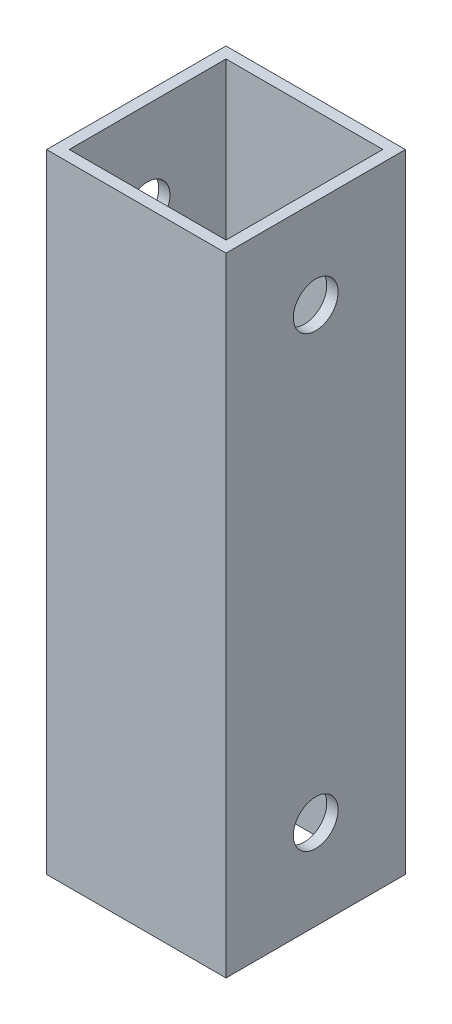
ISO-10303-21;
HEADER;
FILE_DESCRIPTION(('STEP AP214'),'2;1');
FILE_NAME('part.step','',(''),(''),'','','');
FILE_SCHEMA(('AUTOMOTIVE_DESIGN { 1 0 10303 214 1 1 1 1 }'));
ENDSEC;
DATA;
#1=APPLICATION_CONTEXT('core data for automotive mechanical design processes');
#2=APPLICATION_PROTOCOL_DEFINITION('international standard','automotive_design',2000,#1);
#3=PRODUCT_CONTEXT('',#1,'mechanical');
#4=PRODUCT('Part','Part','',(#3));
#5=PRODUCT_RELATED_PRODUCT_CATEGORY('part','',(#4));
#6=PRODUCT_DEFINITION_FORMATION('','',#4);
#7=PRODUCT_DEFINITION_CONTEXT('part definition',#1,'design');
#8=PRODUCT_DEFINITION('design','',#6,#7);
#9=PRODUCT_DEFINITION_SHAPE('','',#8);
#10=(LENGTH_UNIT() NAMED_UNIT(*) SI_UNIT(.MILLI.,.METRE.));
#11=(NAMED_UNIT(*) PLANE_ANGLE_UNIT() SI_UNIT($,.RADIAN.));
#12=(NAMED_UNIT(*) SI_UNIT($,.STERADIAN.) SOLID_ANGLE_UNIT());
#13=UNCERTAINTY_MEASURE_WITH_UNIT(LENGTH_MEASURE(1.E-05),#10,'distance_accuracy_value','');
#14=(GEOMETRIC_REPRESENTATION_CONTEXT(3) GLOBAL_UNCERTAINTY_ASSIGNED_CONTEXT((#13)) GLOBAL_UNIT_ASSIGNED_CONTEXT((#10,
#11,#12)) REPRESENTATION_CONTEXT('',''));
#15=CARTESIAN_POINT('',(0.,0.,0.));
#16=DIRECTION('',(0.,0.,1.));
#17=DIRECTION('',(1.,0.,0.));
#18=AXIS2_PLACEMENT_3D('',#15,#16,#17);
#19=CARTESIAN_POINT('',(0.,177.8,0.));
#20=DIRECTION('',(0.,1.,0.));
#21=DIRECTION('',(0.,0.,1.));
#22=AXIS2_PLACEMENT_3D('',#19,#20,#21);
#23=PLANE('',#22);
#24=DIRECTION('',(0.,0.,1.));
#25=VECTOR('',#24,1.);
#26=CARTESIAN_POINT('',(-25.4,177.8,-25.4));
#27=LINE('',#26,#25);
#28=CARTESIAN_POINT('',(-25.4,177.8,-25.4));
#29=VERTEX_POINT('',#28);
#30=CARTESIAN_POINT('',(-25.4,177.8,25.4));
#31=VERTEX_POINT('',#30);
#32=EDGE_CURVE('E137',#29,#31,#27,.T.);
#33=ORIENTED_EDGE('',*,*,#32,.T.);
#34=DIRECTION('',(1.,0.,0.));
#35=VECTOR('',#34,1.);
#36=CARTESIAN_POINT('',(-25.4,177.8,25.4));
#37=LINE('',#36,#35);
#38=CARTESIAN_POINT('',(25.4,177.8,25.4));
#39=VERTEX_POINT('',#38);
#40=EDGE_CURVE('E140',#31,#39,#37,.T.);
#41=ORIENTED_EDGE('',*,*,#40,.T.);
#42=DIRECTION('',(0.,0.,-1.));
#43=VECTOR('',#42,1.);
#44=CARTESIAN_POINT('',(25.4,177.8,-25.4));
#45=LINE('',#44,#43);
#46=CARTESIAN_POINT('',(25.4,177.8,-25.4));
#47=VERTEX_POINT('',#46);
#48=EDGE_CURVE('E143',#39,#47,#45,.T.);
#49=ORIENTED_EDGE('',*,*,#48,.T.);
#50=DIRECTION('',(-1.,0.,0.));
#51=VECTOR('',#50,1.);
#52=CARTESIAN_POINT('',(-25.4,177.8,-25.4));
#53=LINE('',#52,#51);
#54=EDGE_CURVE('E145',#47,#29,#53,.T.);
#55=ORIENTED_EDGE('',*,*,#54,.T.);
#56=EDGE_LOOP('',(#33,#41,#49,#55));
#57=FACE_BOUND('',#56,.T.);
#58=DIRECTION('',(1.,0.,0.));
#59=VECTOR('',#58,1.);
#60=CARTESIAN_POINT('',(-22.225,177.8,22.1917539267016));
#61=LINE('',#60,#59);
#62=CARTESIAN_POINT('',(-22.225,177.8,22.1917539267016));
#63=VERTEX_POINT('',#62);
#64=CARTESIAN_POINT('',(22.1917539267016,177.8,22.1917539267016));
#65=VERTEX_POINT('',#64);
#66=EDGE_CURVE('E107',#63,#65,#61,.T.);
#67=ORIENTED_EDGE('',*,*,#66,.F.);
#68=DIRECTION('',(0.,0.,1.));
#69=VECTOR('',#68,1.);
#70=CARTESIAN_POINT('',(-22.225,177.8,-22.225));
#71=LINE('',#70,#69);
#72=CARTESIAN_POINT('',(-22.225,177.8,-22.225));
#73=VERTEX_POINT('',#72);
#74=EDGE_CURVE('E99',#73,#63,#71,.T.);
#75=ORIENTED_EDGE('',*,*,#74,.F.);
#76=DIRECTION('',(-1.,0.,0.));
#77=VECTOR('',#76,1.);
#78=CARTESIAN_POINT('',(-22.225,177.8,-22.225));
#79=LINE('',#78,#77);
#80=CARTESIAN_POINT('',(22.1917539267016,177.8,-22.225));
#81=VERTEX_POINT('',#80);
#82=EDGE_CURVE('E121',#81,#73,#79,.T.);
#83=ORIENTED_EDGE('',*,*,#82,.F.);
#84=DIRECTION('',(0.,0.,-1.));
#85=VECTOR('',#84,1.);
#86=CARTESIAN_POINT('',(22.1917539267016,177.8,-22.225));
#87=LINE('',#86,#85);
#88=EDGE_CURVE('E119',#65,#81,#87,.T.);
#89=ORIENTED_EDGE('',*,*,#88,.F.);
#90=EDGE_LOOP('',(#67,#75,#83,#89));
#91=FACE_BOUND('',#90,.T.);
#92=ADVANCED_FACE('F32',(#57,#91),#23,.T.);
#93=CARTESIAN_POINT('',(0.,0.,0.));
#94=DIRECTION('',(0.,1.,0.));
#95=DIRECTION('',(0.,0.,1.));
#96=AXIS2_PLACEMENT_3D('',#93,#94,#95);
#97=PLANE('',#96);
#98=DIRECTION('',(0.,0.,1.));
#99=VECTOR('',#98,1.);
#100=CARTESIAN_POINT('',(-25.4,0.,-25.4));
#101=LINE('',#100,#99);
#102=CARTESIAN_POINT('',(-25.4,0.,-25.4));
#103=VERTEX_POINT('',#102);
#104=CARTESIAN_POINT('',(-25.4,0.,25.4));
#105=VERTEX_POINT('',#104);
#106=EDGE_CURVE('E115',#103,#105,#101,.T.);
#107=ORIENTED_EDGE('',*,*,#106,.F.);
#108=DIRECTION('',(-1.,0.,0.));
#109=VECTOR('',#108,1.);
#110=CARTESIAN_POINT('',(-25.4,0.,-25.4));
#111=LINE('',#110,#109);
#112=CARTESIAN_POINT('',(25.4,0.,-25.4));
#113=VERTEX_POINT('',#112);
#114=EDGE_CURVE('E141',#113,#103,#111,.T.);
#115=ORIENTED_EDGE('',*,*,#114,.F.);
#116=DIRECTION('',(0.,0.,-1.));
#117=VECTOR('',#116,1.);
#118=CARTESIAN_POINT('',(25.4,0.,-25.4));
#119=LINE('',#118,#117);
#120=CARTESIAN_POINT('',(25.4,0.,25.4));
#121=VERTEX_POINT('',#120);
#122=EDGE_CURVE('E152',#121,#113,#119,.T.);
#123=ORIENTED_EDGE('',*,*,#122,.F.);
#124=DIRECTION('',(1.,0.,0.));
#125=VECTOR('',#124,1.);
#126=CARTESIAN_POINT('',(-25.4,0.,25.4));
#127=LINE('',#126,#125);
#128=EDGE_CURVE('E150',#105,#121,#127,.T.);
#129=ORIENTED_EDGE('',*,*,#128,.F.);
#130=EDGE_LOOP('',(#107,#115,#123,#129));
#131=FACE_BOUND('',#130,.T.);
#132=DIRECTION('',(0.,0.,1.));
#133=VECTOR('',#132,1.);
#134=CARTESIAN_POINT('',(-22.225,0.,-22.225));
#135=LINE('',#134,#133);
#136=CARTESIAN_POINT('',(-22.225,0.,-22.225));
#137=VERTEX_POINT('',#136);
#138=CARTESIAN_POINT('',(-22.225,0.,22.1917539267016));
#139=VERTEX_POINT('',#138);
#140=EDGE_CURVE('E57',#137,#139,#135,.T.);
#141=ORIENTED_EDGE('',*,*,#140,.T.);
#142=DIRECTION('',(1.,0.,0.));
#143=VECTOR('',#142,1.);
#144=CARTESIAN_POINT('',(-22.225,0.,22.1917539267016));
#145=LINE('',#144,#143);
#146=CARTESIAN_POINT('',(22.1917539267016,0.,22.1917539267016));
#147=VERTEX_POINT('',#146);
#148=EDGE_CURVE('E114',#139,#147,#145,.T.);
#149=ORIENTED_EDGE('',*,*,#148,.T.);
#150=DIRECTION('',(0.,0.,-1.));
#151=VECTOR('',#150,1.);
#152=CARTESIAN_POINT('',(22.1917539267016,0.,-22.225));
#153=LINE('',#152,#151);
#154=CARTESIAN_POINT('',(22.1917539267016,0.,-22.225));
#155=VERTEX_POINT('',#154);
#156=EDGE_CURVE('E129',#147,#155,#153,.T.);
#157=ORIENTED_EDGE('',*,*,#156,.T.);
#158=DIRECTION('',(-1.,0.,0.));
#159=VECTOR('',#158,1.);
#160=CARTESIAN_POINT('',(-22.225,0.,-22.225));
#161=LINE('',#160,#159);
#162=EDGE_CURVE('E108',#155,#137,#161,.T.);
#163=ORIENTED_EDGE('',*,*,#162,.T.);
#164=EDGE_LOOP('',(#141,#149,#157,#163));
#165=FACE_BOUND('',#164,.T.);
#166=ADVANCED_FACE('F199',(#131,#165),#97,.F.);
#167=CARTESIAN_POINT('',(-25.4,177.8,-25.4));
#168=DIRECTION('',(1.,0.,0.));
#169=DIRECTION('',(0.,0.,-1.));
#170=AXIS2_PLACEMENT_3D('',#167,#168,#169);
#171=PLANE('',#170);
#172=CARTESIAN_POINT('',(-25.4,25.4,0.));
#173=DIRECTION('',(-1.,0.,0.));
#174=DIRECTION('',(0.,0.,1.));
#175=AXIS2_PLACEMENT_3D('',#172,#173,#174);
#176=CIRCLE('',#175,6.35);
#177=CARTESIAN_POINT('',(-25.4,25.4,6.34999999999997));
#178=VERTEX_POINT('',#177);
#179=EDGE_CURVE('E170',#178,#178,#176,.T.);
#180=ORIENTED_EDGE('',*,*,#179,.F.);
#181=EDGE_LOOP('',(#180));
#182=FACE_BOUND('',#181,.T.);
#183=CARTESIAN_POINT('',(-25.4,152.4,0.));
#184=DIRECTION('',(-1.,0.,0.));
#185=DIRECTION('',(0.,0.,1.));
#186=AXIS2_PLACEMENT_3D('',#183,#184,#185);
#187=CIRCLE('',#186,6.34999999999999);
#188=CARTESIAN_POINT('',(-25.4,152.4,6.34999999999995));
#189=VERTEX_POINT('',#188);
#190=EDGE_CURVE('E180',#189,#189,#187,.T.);
#191=ORIENTED_EDGE('',*,*,#190,.F.);
#192=EDGE_LOOP('',(#191));
#193=FACE_BOUND('',#192,.T.);
#194=ORIENTED_EDGE('',*,*,#106,.T.);
#195=DIRECTION('',(0.,-1.,0.));
#196=VECTOR('',#195,1.);
#197=CARTESIAN_POINT('',(-25.4,177.8,25.4));
#198=LINE('',#197,#196);
#199=EDGE_CURVE('E11',#31,#105,#198,.T.);
#200=ORIENTED_EDGE('',*,*,#199,.F.);
#201=ORIENTED_EDGE('',*,*,#32,.F.);
#202=DIRECTION('',(0.,-1.,0.));
#203=VECTOR('',#202,1.);
#204=CARTESIAN_POINT('',(-25.4,177.8,-25.4));
#205=LINE('',#204,#203);
#206=EDGE_CURVE('E147',#29,#103,#205,.T.);
#207=ORIENTED_EDGE('',*,*,#206,.T.);
#208=EDGE_LOOP('',(#194,#200,#201,#207));
#209=FACE_BOUND('',#208,.T.);
#210=ADVANCED_FACE('F34',(#182,#193,#209),#171,.F.);
#211=CARTESIAN_POINT('',(-25.4,177.8,25.4));
#212=DIRECTION('',(0.,0.,-1.));
#213=DIRECTION('',(-1.,0.,0.));
#214=AXIS2_PLACEMENT_3D('',#211,#212,#213);
#215=PLANE('',#214);
#216=ORIENTED_EDGE('',*,*,#128,.T.);
#217=DIRECTION('',(0.,-1.,0.));
#218=VECTOR('',#217,1.);
#219=CARTESIAN_POINT('',(25.4,177.8,25.4));
#220=LINE('',#219,#218);
#221=EDGE_CURVE('E41',#39,#121,#220,.T.);
#222=ORIENTED_EDGE('',*,*,#221,.F.);
#223=ORIENTED_EDGE('',*,*,#40,.F.);
#224=ORIENTED_EDGE('',*,*,#199,.T.);
#225=EDGE_LOOP('',(#216,#222,#223,#224));
#226=FACE_BOUND('',#225,.T.);
#227=ADVANCED_FACE('F225',(#226),#215,.F.);
#228=CARTESIAN_POINT('',(25.4,177.8,-25.4));
#229=DIRECTION('',(-1.,0.,0.));
#230=DIRECTION('',(0.,0.,1.));
#231=AXIS2_PLACEMENT_3D('',#228,#229,#230);
#232=PLANE('',#231);
#233=CARTESIAN_POINT('',(25.4,25.4,0.));
#234=DIRECTION('',(-1.,0.,0.));
#235=DIRECTION('',(0.,0.,1.));
#236=AXIS2_PLACEMENT_3D('',#233,#234,#235);
#237=CIRCLE('',#236,6.35);
#238=CARTESIAN_POINT('',(25.4,25.4,6.34999999999996));
#239=VERTEX_POINT('',#238);
#240=EDGE_CURVE('E164',#239,#239,#237,.T.);
#241=ORIENTED_EDGE('',*,*,#240,.T.);
#242=EDGE_LOOP('',(#241));
#243=FACE_BOUND('',#242,.T.);
#244=CARTESIAN_POINT('',(25.4,152.4,0.));
#245=DIRECTION('',(-1.,0.,0.));
#246=DIRECTION('',(0.,0.,1.));
#247=AXIS2_PLACEMENT_3D('',#244,#245,#246);
#248=CIRCLE('',#247,6.34999999999999);
#249=CARTESIAN_POINT('',(25.4,152.4,6.34999999999993));
#250=VERTEX_POINT('',#249);
#251=EDGE_CURVE('E175',#250,#250,#248,.T.);
#252=ORIENTED_EDGE('',*,*,#251,.T.);
#253=EDGE_LOOP('',(#252));
#254=FACE_BOUND('',#253,.T.);
#255=ORIENTED_EDGE('',*,*,#122,.T.);
#256=DIRECTION('',(0.,-1.,0.));
#257=VECTOR('',#256,1.);
#258=CARTESIAN_POINT('',(25.4,177.8,-25.4));
#259=LINE('',#258,#257);
#260=EDGE_CURVE('E157',#47,#113,#259,.T.);
#261=ORIENTED_EDGE('',*,*,#260,.F.);
#262=ORIENTED_EDGE('',*,*,#48,.F.);
#263=ORIENTED_EDGE('',*,*,#221,.T.);
#264=EDGE_LOOP('',(#255,#261,#262,#263));
#265=FACE_BOUND('',#264,.T.);
#266=ADVANCED_FACE('F222',(#243,#254,#265),#232,.F.);
#267=CARTESIAN_POINT('',(-25.4,177.8,-25.4));
#268=DIRECTION('',(0.,0.,1.));
#269=DIRECTION('',(1.,0.,0.));
#270=AXIS2_PLACEMENT_3D('',#267,#268,#269);
#271=PLANE('',#270);
#272=ORIENTED_EDGE('',*,*,#114,.T.);
#273=ORIENTED_EDGE('',*,*,#206,.F.);
#274=ORIENTED_EDGE('',*,*,#54,.F.);
#275=ORIENTED_EDGE('',*,*,#260,.T.);
#276=EDGE_LOOP('',(#272,#273,#274,#275));
#277=FACE_BOUND('',#276,.T.);
#278=ADVANCED_FACE('F219',(#277),#271,.F.);
#279=CARTESIAN_POINT('',(-22.225,177.8,-22.225));
#280=DIRECTION('',(1.,0.,0.));
#281=DIRECTION('',(0.,0.,-1.));
#282=AXIS2_PLACEMENT_3D('',#279,#280,#281);
#283=PLANE('',#282);
#284=CARTESIAN_POINT('',(-22.225,25.4,0.));
#285=DIRECTION('',(1.,0.,0.));
#286=DIRECTION('',(0.,0.,-1.));
#287=AXIS2_PLACEMENT_3D('',#284,#285,#286);
#288=CIRCLE('',#287,6.35);
#289=CARTESIAN_POINT('',(-22.225,25.4,-6.35000000000002));
#290=VERTEX_POINT('',#289);
#291=EDGE_CURVE('E127',#290,#290,#288,.T.);
#292=ORIENTED_EDGE('',*,*,#291,.F.);
#293=EDGE_LOOP('',(#292));
#294=FACE_BOUND('',#293,.T.);
#295=CARTESIAN_POINT('',(-22.225,152.4,0.));
#296=DIRECTION('',(1.,0.,0.));
#297=DIRECTION('',(0.,0.,-1.));
#298=AXIS2_PLACEMENT_3D('',#295,#296,#297);
#299=CIRCLE('',#298,6.34999999999999);
#300=CARTESIAN_POINT('',(-22.225,152.4,-6.35000000000004));
#301=VERTEX_POINT('',#300);
#302=EDGE_CURVE('E163',#301,#301,#299,.T.);
#303=ORIENTED_EDGE('',*,*,#302,.F.);
#304=EDGE_LOOP('',(#303));
#305=FACE_BOUND('',#304,.T.);
#306=ORIENTED_EDGE('',*,*,#140,.F.);
#307=DIRECTION('',(0.,-1.,0.));
#308=VECTOR('',#307,1.);
#309=CARTESIAN_POINT('',(-22.225,177.8,-22.225));
#310=LINE('',#309,#308);
#311=EDGE_CURVE('E103',#73,#137,#310,.T.);
#312=ORIENTED_EDGE('',*,*,#311,.F.);
#313=ORIENTED_EDGE('',*,*,#74,.T.);
#314=DIRECTION('',(0.,-1.,0.));
#315=VECTOR('',#314,1.);
#316=CARTESIAN_POINT('',(-22.225,177.8,22.1917539267016));
#317=LINE('',#316,#315);
#318=EDGE_CURVE('E102',#63,#139,#317,.T.);
#319=ORIENTED_EDGE('',*,*,#318,.T.);
#320=EDGE_LOOP('',(#306,#312,#313,#319));
#321=FACE_BOUND('',#320,.T.);
#322=ADVANCED_FACE('F101',(#294,#305,#321),#283,.T.);
#323=CARTESIAN_POINT('',(-22.225,177.8,22.1917539267016));
#324=DIRECTION('',(0.,0.,-1.));
#325=DIRECTION('',(-1.,0.,0.));
#326=AXIS2_PLACEMENT_3D('',#323,#324,#325);
#327=PLANE('',#326);
#328=ORIENTED_EDGE('',*,*,#148,.F.);
#329=ORIENTED_EDGE('',*,*,#318,.F.);
#330=ORIENTED_EDGE('',*,*,#66,.T.);
#331=DIRECTION('',(0.,-1.,0.));
#332=VECTOR('',#331,1.);
#333=CARTESIAN_POINT('',(22.1917539267016,177.8,22.1917539267016));
#334=LINE('',#333,#332);
#335=EDGE_CURVE('E116',#65,#147,#334,.T.);
#336=ORIENTED_EDGE('',*,*,#335,.T.);
#337=EDGE_LOOP('',(#328,#329,#330,#336));
#338=FACE_BOUND('',#337,.T.);
#339=ADVANCED_FACE('F111',(#338),#327,.T.);
#340=CARTESIAN_POINT('',(22.1917539267016,177.8,-22.225));
#341=DIRECTION('',(-1.,0.,0.));
#342=DIRECTION('',(0.,0.,1.));
#343=AXIS2_PLACEMENT_3D('',#340,#341,#342);
#344=PLANE('',#343);
#345=CARTESIAN_POINT('',(22.1917539267016,25.4,0.));
#346=DIRECTION('',(-1.,0.,0.));
#347=DIRECTION('',(0.,0.,1.));
#348=AXIS2_PLACEMENT_3D('',#345,#346,#347);
#349=CIRCLE('',#348,6.35);
#350=CARTESIAN_POINT('',(22.1917539267016,25.4,6.34999999999996));
#351=VERTEX_POINT('',#350);
#352=EDGE_CURVE('E36',#351,#351,#349,.T.);
#353=ORIENTED_EDGE('',*,*,#352,.F.);
#354=EDGE_LOOP('',(#353));
#355=FACE_BOUND('',#354,.T.);
#356=CARTESIAN_POINT('',(22.1917539267016,152.4,0.));
#357=DIRECTION('',(-1.,0.,0.));
#358=DIRECTION('',(0.,0.,1.));
#359=AXIS2_PLACEMENT_3D('',#356,#357,#358);
#360=CIRCLE('',#359,6.34999999999999);
#361=CARTESIAN_POINT('',(22.1917539267016,152.4,6.34999999999993));
#362=VERTEX_POINT('',#361);
#363=EDGE_CURVE('E161',#362,#362,#360,.T.);
#364=ORIENTED_EDGE('',*,*,#363,.F.);
#365=EDGE_LOOP('',(#364));
#366=FACE_BOUND('',#365,.T.);
#367=ORIENTED_EDGE('',*,*,#156,.F.);
#368=ORIENTED_EDGE('',*,*,#335,.F.);
#369=ORIENTED_EDGE('',*,*,#88,.T.);
#370=DIRECTION('',(0.,-1.,0.));
#371=VECTOR('',#370,1.);
#372=CARTESIAN_POINT('',(22.1917539267016,177.8,-22.225));
#373=LINE('',#372,#371);
#374=EDGE_CURVE('E49',#81,#155,#373,.T.);
#375=ORIENTED_EDGE('',*,*,#374,.T.);
#376=EDGE_LOOP('',(#367,#368,#369,#375));
#377=FACE_BOUND('',#376,.T.);
#378=ADVANCED_FACE('F191',(#355,#366,#377),#344,.T.);
#379=CARTESIAN_POINT('',(-22.225,177.8,-22.225));
#380=DIRECTION('',(0.,0.,1.));
#381=DIRECTION('',(1.,0.,0.));
#382=AXIS2_PLACEMENT_3D('',#379,#380,#381);
#383=PLANE('',#382);
#384=ORIENTED_EDGE('',*,*,#162,.F.);
#385=ORIENTED_EDGE('',*,*,#374,.F.);
#386=ORIENTED_EDGE('',*,*,#82,.T.);
#387=ORIENTED_EDGE('',*,*,#311,.T.);
#388=EDGE_LOOP('',(#384,#385,#386,#387));
#389=FACE_BOUND('',#388,.T.);
#390=ADVANCED_FACE('F194',(#389),#383,.T.);
#391=CARTESIAN_POINT('',(25.4,152.4,0.));
#392=DIRECTION('',(-1.,0.,0.));
#393=DIRECTION('',(0.,0.,1.));
#394=AXIS2_PLACEMENT_3D('',#391,#392,#393);
#395=CYLINDRICAL_SURFACE('',#394,6.34999999999999);
#396=ORIENTED_EDGE('',*,*,#363,.T.);
#397=EDGE_LOOP('',(#396));
#398=FACE_BOUND('',#397,.T.);
#399=ORIENTED_EDGE('',*,*,#251,.F.);
#400=EDGE_LOOP('',(#399));
#401=FACE_BOUND('',#400,.T.);
#402=ADVANCED_FACE('F201',(#398,#401),#395,.F.);
#403=CARTESIAN_POINT('',(25.4,25.4,0.));
#404=DIRECTION('',(-1.,0.,0.));
#405=DIRECTION('',(0.,0.,1.));
#406=AXIS2_PLACEMENT_3D('',#403,#404,#405);
#407=CYLINDRICAL_SURFACE('',#406,6.35);
#408=ORIENTED_EDGE('',*,*,#352,.T.);
#409=EDGE_LOOP('',(#408));
#410=FACE_BOUND('',#409,.T.);
#411=ORIENTED_EDGE('',*,*,#240,.F.);
#412=EDGE_LOOP('',(#411));
#413=FACE_BOUND('',#412,.T.);
#414=ADVANCED_FACE('F188',(#410,#413),#407,.F.);
#415=ORIENTED_EDGE('',*,*,#302,.T.);
#416=EDGE_LOOP('',(#415));
#417=FACE_BOUND('',#416,.T.);
#418=ORIENTED_EDGE('',*,*,#190,.T.);
#419=EDGE_LOOP('',(#418));
#420=FACE_BOUND('',#419,.T.);
#421=ADVANCED_FACE('F207',(#417,#420),#395,.F.);
#422=ORIENTED_EDGE('',*,*,#291,.T.);
#423=EDGE_LOOP('',(#422));
#424=FACE_BOUND('',#423,.T.);
#425=ORIENTED_EDGE('',*,*,#179,.T.);
#426=EDGE_LOOP('',(#425));
#427=FACE_BOUND('',#426,.T.);
#428=ADVANCED_FACE('F251',(#424,#427),#407,.F.);
#429=CLOSED_SHELL('',(#92,#166,#210,#227,#266,#278,#322,#339,#378,#390,#402,#414,#421,#428));
#430=MANIFOLD_SOLID_BREP('B2',#429);
#431=ADVANCED_BREP_SHAPE_REPRESENTATION('',(#18,#430),#14);
#432=SHAPE_DEFINITION_REPRESENTATION(#9,#431);
ENDSEC;
END-ISO-10303-21;
